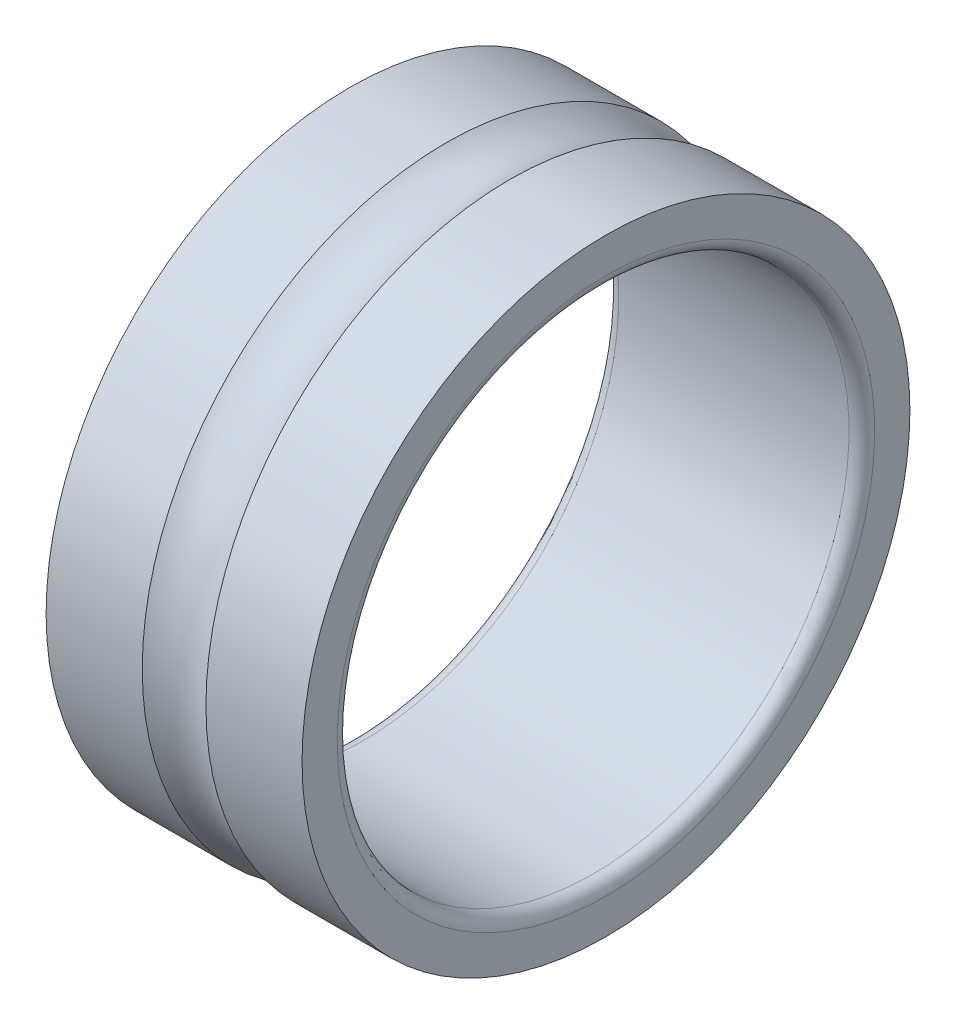
ISO-10303-21;
HEADER;
FILE_DESCRIPTION(('STEP AP214'),'2;1');
FILE_NAME('part.step','',(''),(''),'','','');
FILE_SCHEMA(('AUTOMOTIVE_DESIGN { 1 0 10303 214 1 1 1 1 }'));
ENDSEC;
DATA;
#1=APPLICATION_CONTEXT('core data for automotive mechanical design processes');
#2=APPLICATION_PROTOCOL_DEFINITION('international standard','automotive_design',2000,#1);
#3=PRODUCT_CONTEXT('',#1,'mechanical');
#4=PRODUCT('Part','Part','',(#3));
#5=PRODUCT_RELATED_PRODUCT_CATEGORY('part','',(#4));
#6=PRODUCT_DEFINITION_FORMATION('','',#4);
#7=PRODUCT_DEFINITION_CONTEXT('part definition',#1,'design');
#8=PRODUCT_DEFINITION('design','',#6,#7);
#9=PRODUCT_DEFINITION_SHAPE('','',#8);
#10=(LENGTH_UNIT() NAMED_UNIT(*) SI_UNIT(.MILLI.,.METRE.));
#11=(NAMED_UNIT(*) PLANE_ANGLE_UNIT() SI_UNIT($,.RADIAN.));
#12=(NAMED_UNIT(*) SI_UNIT($,.STERADIAN.) SOLID_ANGLE_UNIT());
#13=UNCERTAINTY_MEASURE_WITH_UNIT(LENGTH_MEASURE(1.E-05),#10,'distance_accuracy_value','');
#14=(GEOMETRIC_REPRESENTATION_CONTEXT(3) GLOBAL_UNCERTAINTY_ASSIGNED_CONTEXT((#13)) GLOBAL_UNIT_ASSIGNED_CONTEXT((#10,
#11,#12)) REPRESENTATION_CONTEXT('',''));
#15=CARTESIAN_POINT('',(0.,0.,0.));
#16=DIRECTION('',(0.,0.,1.));
#17=DIRECTION('',(1.,0.,0.));
#18=AXIS2_PLACEMENT_3D('',#15,#16,#17);
#19=CARTESIAN_POINT('',(2.,0.,0.));
#20=DIRECTION('',(-1.,0.,0.));
#21=DIRECTION('',(0.,0.,1.));
#22=AXIS2_PLACEMENT_3D('',#19,#20,#21);
#23=CYLINDRICAL_SURFACE('',#22,2.375);
#24=CARTESIAN_POINT('',(0.,0.,0.));
#25=DIRECTION('',(-1.,0.,0.));
#26=DIRECTION('',(0.,0.,1.));
#27=AXIS2_PLACEMENT_3D('',#24,#25,#26);
#28=CIRCLE('',#27,2.375);
#29=CARTESIAN_POINT('',(0.,0.,2.375));
#30=VERTEX_POINT('',#29);
#31=EDGE_CURVE('E10',#30,#30,#28,.T.);
#32=ORIENTED_EDGE('',*,*,#31,.F.);
#33=EDGE_LOOP('',(#32));
#34=FACE_BOUND('',#33,.T.);
#35=CARTESIAN_POINT('',(0.75125314072335,0.,0.));
#36=DIRECTION('',(-1.,0.,0.));
#37=DIRECTION('',(0.,0.,1.));
#38=AXIS2_PLACEMENT_3D('',#35,#36,#37);
#39=CIRCLE('',#38,2.375);
#40=CARTESIAN_POINT('',(0.75125314072335,0.,2.375));
#41=VERTEX_POINT('',#40);
#42=EDGE_CURVE('E57',#41,#41,#39,.T.);
#43=ORIENTED_EDGE('',*,*,#42,.T.);
#44=EDGE_LOOP('',(#43));
#45=FACE_BOUND('',#44,.T.);
#46=ADVANCED_FACE('F29',(#34,#45),#23,.T.);
#47=CARTESIAN_POINT('',(0.,2.375,0.));
#48=DIRECTION('',(1.,0.,0.));
#49=DIRECTION('',(0.,0.,-1.));
#50=AXIS2_PLACEMENT_3D('',#47,#48,#49);
#51=PLANE('',#50);
#52=CARTESIAN_POINT('',(0.,0.,0.));
#53=DIRECTION('',(-1.,0.,0.));
#54=DIRECTION('',(0.,0.,1.));
#55=AXIS2_PLACEMENT_3D('',#52,#53,#54);
#56=CIRCLE('',#55,2.1);
#57=CARTESIAN_POINT('',(0.,0.,2.1));
#58=VERTEX_POINT('',#57);
#59=EDGE_CURVE('E35',#58,#58,#56,.T.);
#60=ORIENTED_EDGE('',*,*,#59,.F.);
#61=EDGE_LOOP('',(#60));
#62=FACE_BOUND('',#61,.T.);
#63=ORIENTED_EDGE('',*,*,#31,.T.);
#64=EDGE_LOOP('',(#63));
#65=FACE_BOUND('',#64,.T.);
#66=ADVANCED_FACE('F94',(#62,#65),#51,.F.);
#67=CARTESIAN_POINT('',(0.0999999999999225,0.,0.));
#68=DIRECTION('',(-1.,0.,0.));
#69=DIRECTION('',(0.,0.,1.));
#70=AXIS2_PLACEMENT_3D('',#67,#68,#69);
#71=TOROIDAL_SURFACE('',#70,2.09999999999992,0.0999999999999224);
#72=CARTESIAN_POINT('',(0.1,0.,0.));
#73=DIRECTION('',(-1.,0.,0.));
#74=DIRECTION('',(0.,0.,1.));
#75=AXIS2_PLACEMENT_3D('',#72,#73,#74);
#76=CIRCLE('',#75,2.);
#77=CARTESIAN_POINT('',(0.1,0.,2.));
#78=VERTEX_POINT('',#77);
#79=EDGE_CURVE('E39',#78,#78,#76,.T.);
#80=ORIENTED_EDGE('',*,*,#79,.F.);
#81=EDGE_LOOP('',(#80));
#82=FACE_BOUND('',#81,.T.);
#83=ORIENTED_EDGE('',*,*,#59,.T.);
#84=EDGE_LOOP('',(#83));
#85=FACE_BOUND('',#84,.T.);
#86=ADVANCED_FACE('F89',(#82,#85),#71,.T.);
#87=CARTESIAN_POINT('',(2.,0.,0.));
#88=DIRECTION('',(-1.,0.,0.));
#89=DIRECTION('',(0.,0.,1.));
#90=AXIS2_PLACEMENT_3D('',#87,#88,#89);
#91=CYLINDRICAL_SURFACE('',#90,2.);
#92=CARTESIAN_POINT('',(1.9,0.,0.));
#93=DIRECTION('',(-1.,0.,0.));
#94=DIRECTION('',(0.,0.,1.));
#95=AXIS2_PLACEMENT_3D('',#92,#93,#94);
#96=CIRCLE('',#95,2.);
#97=CARTESIAN_POINT('',(1.9,0.,2.));
#98=VERTEX_POINT('',#97);
#99=EDGE_CURVE('E43',#98,#98,#96,.T.);
#100=ORIENTED_EDGE('',*,*,#99,.F.);
#101=EDGE_LOOP('',(#100));
#102=FACE_BOUND('',#101,.T.);
#103=ORIENTED_EDGE('',*,*,#79,.T.);
#104=EDGE_LOOP('',(#103));
#105=FACE_BOUND('',#104,.T.);
#106=ADVANCED_FACE('F83',(#102,#105),#91,.F.);
#107=CARTESIAN_POINT('',(1.90000000000016,0.,0.));
#108=DIRECTION('',(-1.,0.,0.));
#109=DIRECTION('',(0.,0.,1.));
#110=AXIS2_PLACEMENT_3D('',#107,#108,#109);
#111=TOROIDAL_SURFACE('',#110,2.09999999999984,0.0999999999998447);
#112=CARTESIAN_POINT('',(2.,0.,0.));
#113=DIRECTION('',(-1.,0.,0.));
#114=DIRECTION('',(0.,0.,1.));
#115=AXIS2_PLACEMENT_3D('',#112,#113,#114);
#116=CIRCLE('',#115,2.1);
#117=CARTESIAN_POINT('',(2.,0.,2.1));
#118=VERTEX_POINT('',#117);
#119=EDGE_CURVE('E48',#118,#118,#116,.T.);
#120=ORIENTED_EDGE('',*,*,#119,.F.);
#121=EDGE_LOOP('',(#120));
#122=FACE_BOUND('',#121,.T.);
#123=ORIENTED_EDGE('',*,*,#99,.T.);
#124=EDGE_LOOP('',(#123));
#125=FACE_BOUND('',#124,.T.);
#126=ADVANCED_FACE('F77',(#122,#125),#111,.T.);
#127=CARTESIAN_POINT('',(2.,2.1,0.));
#128=DIRECTION('',(-1.,0.,0.));
#129=DIRECTION('',(0.,0.,1.));
#130=AXIS2_PLACEMENT_3D('',#127,#128,#129);
#131=PLANE('',#130);
#132=CARTESIAN_POINT('',(2.,0.,0.));
#133=DIRECTION('',(-1.,0.,0.));
#134=DIRECTION('',(0.,0.,1.));
#135=AXIS2_PLACEMENT_3D('',#132,#133,#134);
#136=CIRCLE('',#135,2.375);
#137=CARTESIAN_POINT('',(2.,0.,2.375));
#138=VERTEX_POINT('',#137);
#139=EDGE_CURVE('E51',#138,#138,#136,.T.);
#140=ORIENTED_EDGE('',*,*,#139,.F.);
#141=EDGE_LOOP('',(#140));
#142=FACE_BOUND('',#141,.T.);
#143=ORIENTED_EDGE('',*,*,#119,.T.);
#144=EDGE_LOOP('',(#143));
#145=FACE_BOUND('',#144,.T.);
#146=ADVANCED_FACE('F71',(#142,#145),#131,.F.);
#147=CARTESIAN_POINT('',(2.,0.,0.));
#148=DIRECTION('',(-1.,0.,0.));
#149=DIRECTION('',(0.,0.,1.));
#150=AXIS2_PLACEMENT_3D('',#147,#148,#149);
#151=CYLINDRICAL_SURFACE('',#150,2.375);
#152=CARTESIAN_POINT('',(1.2487468592767,0.,0.));
#153=DIRECTION('',(-1.,0.,0.));
#154=DIRECTION('',(0.,0.,1.));
#155=AXIS2_PLACEMENT_3D('',#152,#153,#154);
#156=CIRCLE('',#155,2.375);
#157=CARTESIAN_POINT('',(1.2487468592767,0.,2.375));
#158=VERTEX_POINT('',#157);
#159=EDGE_CURVE('E54',#158,#158,#156,.T.);
#160=ORIENTED_EDGE('',*,*,#159,.F.);
#161=EDGE_LOOP('',(#160));
#162=FACE_BOUND('',#161,.T.);
#163=ORIENTED_EDGE('',*,*,#139,.T.);
#164=EDGE_LOOP('',(#163));
#165=FACE_BOUND('',#164,.T.);
#166=ADVANCED_FACE('F65',(#162,#165),#151,.T.);
#167=CARTESIAN_POINT('',(1.00000000000002,0.,0.));
#168=DIRECTION('',(-1.,0.,0.));
#169=DIRECTION('',(0.,0.,1.));
#170=AXIS2_PLACEMENT_3D('',#167,#168,#169);
#171=TOROIDAL_SURFACE('',#170,2.75000000000007,0.450000000000067);
#172=ORIENTED_EDGE('',*,*,#42,.F.);
#173=EDGE_LOOP('',(#172));
#174=FACE_BOUND('',#173,.T.);
#175=ORIENTED_EDGE('',*,*,#159,.T.);
#176=EDGE_LOOP('',(#175));
#177=FACE_BOUND('',#176,.T.);
#178=ADVANCED_FACE('F62',(#174,#177),#171,.F.);
#179=CLOSED_SHELL('',(#46,#66,#86,#106,#126,#146,#166,#178));
#180=MANIFOLD_SOLID_BREP('B2',#179);
#181=ADVANCED_BREP_SHAPE_REPRESENTATION('',(#18,#180),#14);
#182=SHAPE_DEFINITION_REPRESENTATION(#9,#181);
ENDSEC;
END-ISO-10303-21;
